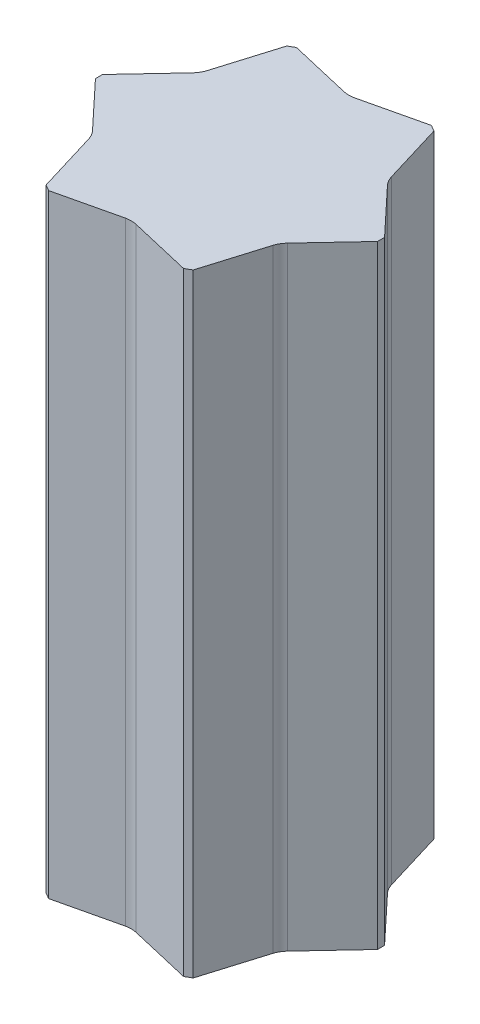
ISO-10303-21;
HEADER;
FILE_DESCRIPTION(('STEP AP214'),'2;1');
FILE_NAME('part.step','',(''),(''),'','','');
FILE_SCHEMA(('AUTOMOTIVE_DESIGN { 1 0 10303 214 1 1 1 1 }'));
ENDSEC;
DATA;
#1=APPLICATION_CONTEXT('core data for automotive mechanical design processes');
#2=APPLICATION_PROTOCOL_DEFINITION('international standard','automotive_design',2000,#1);
#3=PRODUCT_CONTEXT('',#1,'mechanical');
#4=PRODUCT('Part','Part','',(#3));
#5=PRODUCT_RELATED_PRODUCT_CATEGORY('part','',(#4));
#6=PRODUCT_DEFINITION_FORMATION('','',#4);
#7=PRODUCT_DEFINITION_CONTEXT('part definition',#1,'design');
#8=PRODUCT_DEFINITION('design','',#6,#7);
#9=PRODUCT_DEFINITION_SHAPE('','',#8);
#10=(LENGTH_UNIT() NAMED_UNIT(*) SI_UNIT(.MILLI.,.METRE.));
#11=(NAMED_UNIT(*) PLANE_ANGLE_UNIT() SI_UNIT($,.RADIAN.));
#12=(NAMED_UNIT(*) SI_UNIT($,.STERADIAN.) SOLID_ANGLE_UNIT());
#13=UNCERTAINTY_MEASURE_WITH_UNIT(LENGTH_MEASURE(1.E-05),#10,'distance_accuracy_value','');
#14=(GEOMETRIC_REPRESENTATION_CONTEXT(3) GLOBAL_UNCERTAINTY_ASSIGNED_CONTEXT((#13)) GLOBAL_UNIT_ASSIGNED_CONTEXT((#10,
#11,#12)) REPRESENTATION_CONTEXT('',''));
#15=CARTESIAN_POINT('',(0.,0.,0.));
#16=DIRECTION('',(0.,0.,1.));
#17=DIRECTION('',(1.,0.,0.));
#18=AXIS2_PLACEMENT_3D('',#15,#16,#17);
#19=CARTESIAN_POINT('',(0.,1500.,0.));
#20=DIRECTION('',(0.,1.,0.));
#21=DIRECTION('',(0.,0.,1.));
#22=AXIS2_PLACEMENT_3D('',#19,#20,#21);
#23=PLANE('',#22);
#24=CARTESIAN_POINT('',(-279.782642064794,1500.,161.53258371069));
#25=DIRECTION('',(0.,1.,0.));
#26=DIRECTION('',(0.,0.,1.));
#27=AXIS2_PLACEMENT_3D('',#24,#25,#26);
#28=CIRCLE('',#27,57.0000000000118);
#29=CARTESIAN_POINT('',(-225.221371389546,1500.,145.038107595835));
#30=VERTEX_POINT('',#29);
#31=CARTESIAN_POINT('',(-238.21737138956,1500.,122.528375300625));
#32=VERTEX_POINT('',#31);
#33=EDGE_CURVE('E335',#30,#32,#28,.T.);
#34=ORIENTED_EDGE('',*,*,#33,.F.);
#35=DIRECTION('',(-0.289687341997274,0.,-0.957121331852213));
#36=VECTOR('',#35,1.);
#37=CARTESIAN_POINT('',(-225.221371389546,1500.,145.038107595835));
#38=LINE('',#37,#36);
#39=CARTESIAN_POINT('',(-179.999999999989,1500.,294.448637286717));
#40=VERTEX_POINT('',#39);
#41=EDGE_CURVE('E330',#40,#30,#38,.T.);
#42=ORIENTED_EDGE('',*,*,#41,.F.);
#43=DIRECTION('',(0.866025403784445,0.,0.499999999999989));
#44=VECTOR('',#43,1.);
#45=CARTESIAN_POINT('',(-180.,1500.,294.448637286709));
#46=LINE('',#45,#44);
#47=CARTESIAN_POINT('',(-164.999999999985,1500.,303.108891324554));
#48=VERTEX_POINT('',#47);
#49=EDGE_CURVE('E233',#40,#48,#46,.T.);
#50=ORIENTED_EDGE('',*,*,#49,.T.);
#51=DIRECTION('',(-0.973735058886646,0.,0.227684068601694));
#52=VECTOR('',#51,1.);
#53=CARTESIAN_POINT('',(-12.996000000002,1500.,267.566482896435));
#54=LINE('',#53,#52);
#55=CARTESIAN_POINT('',(-12.9960000000026,1500.,267.566482896433));
#56=VERTEX_POINT('',#55);
#57=EDGE_CURVE('E478',#56,#48,#54,.T.);
#58=ORIENTED_EDGE('',*,*,#57,.F.);
#59=CARTESIAN_POINT('',(-2.25942145351596E-12,1500.,323.065167421386));
#60=DIRECTION('',(0.,1.,0.));
#61=DIRECTION('',(0.,0.,1.));
#62=AXIS2_PLACEMENT_3D('',#59,#60,#61);
#63=CIRCLE('',#62,57.0000000000025);
#64=CARTESIAN_POINT('',(12.9960000000444,1500.,267.566482896441));
#65=VERTEX_POINT('',#64);
#66=EDGE_CURVE('E471',#65,#56,#63,.T.);
#67=ORIENTED_EDGE('',*,*,#66,.F.);
#68=DIRECTION('',(-0.97373505888665,0.,-0.227684068601677));
#69=VECTOR('',#68,1.);
#70=CARTESIAN_POINT('',(12.9960000000444,1500.,267.566482896441));
#71=LINE('',#70,#69);
#72=CARTESIAN_POINT('',(165.000000000015,1500.,303.108891324554));
#73=VERTEX_POINT('',#72);
#74=EDGE_CURVE('E467',#73,#65,#71,.T.);
#75=ORIENTED_EDGE('',*,*,#74,.F.);
#76=DIRECTION('',(0.866025403784436,0.,-0.500000000000004));
#77=VECTOR('',#76,1.);
#78=CARTESIAN_POINT('',(165.,1500.,303.108891324553));
#79=LINE('',#78,#77);
#80=CARTESIAN_POINT('',(180.000000000012,1500.,294.448637286703));
#81=VERTEX_POINT('',#80);
#82=EDGE_CURVE('E241',#73,#81,#79,.T.);
#83=ORIENTED_EDGE('',*,*,#82,.T.);
#84=DIRECTION('',(-0.289687341997226,0.,0.957121331852228));
#85=VECTOR('',#84,1.);
#86=CARTESIAN_POINT('',(225.221371389567,1500.,145.038107595801));
#87=LINE('',#86,#85);
#88=CARTESIAN_POINT('',(225.221371389566,1500.,145.038107595801));
#89=VERTEX_POINT('',#88);
#90=EDGE_CURVE('E382',#89,#81,#87,.T.);
#91=ORIENTED_EDGE('',*,*,#90,.F.);
#92=CARTESIAN_POINT('',(279.782642064801,1500.,161.532583710706));
#93=DIRECTION('',(0.,1.,0.));
#94=DIRECTION('',(0.,0.,1.));
#95=AXIS2_PLACEMENT_3D('',#92,#93,#94);
#96=CIRCLE('',#95,57.000000000012);
#97=CARTESIAN_POINT('',(238.217371389598,1500.,122.528375300606));
#98=VERTEX_POINT('',#97);
#99=EDGE_CURVE('E379',#98,#89,#96,.T.);
#100=ORIENTED_EDGE('',*,*,#99,.F.);
#101=DIRECTION('',(-0.684047716889375,0.,0.729437263250537));
#102=VECTOR('',#101,1.);
#103=CARTESIAN_POINT('',(238.217371389598,1500.,122.528375300606));
#104=LINE('',#103,#102);
#105=CARTESIAN_POINT('',(345.000000000012,1500.,8.66025403783843));
#106=VERTEX_POINT('',#105);
#107=EDGE_CURVE('E376',#106,#98,#104,.T.);
#108=ORIENTED_EDGE('',*,*,#107,.F.);
#109=DIRECTION('',(0.,0.,-1.));
#110=VECTOR('',#109,1.);
#111=CARTESIAN_POINT('',(345.,1500.,-8.66025403784437));
#112=LINE('',#111,#110);
#113=CARTESIAN_POINT('',(345.,1500.,-8.6602540378436));
#114=VERTEX_POINT('',#113);
#115=EDGE_CURVE('E252',#106,#114,#112,.T.);
#116=ORIENTED_EDGE('',*,*,#115,.T.);
#117=DIRECTION('',(0.684047716889376,0.,0.729437263250536));
#118=VECTOR('',#117,1.);
#119=CARTESIAN_POINT('',(238.217371389575,1500.,-122.528375300623));
#120=LINE('',#119,#118);
#121=CARTESIAN_POINT('',(238.217371389575,1500.,-122.528375300623));
#122=VERTEX_POINT('',#121);
#123=EDGE_CURVE('E409',#122,#114,#120,.T.);
#124=ORIENTED_EDGE('',*,*,#123,.F.);
#125=CARTESIAN_POINT('',(279.782642064811,1500.,-161.532583710687));
#126=DIRECTION('',(0.,1.,0.));
#127=DIRECTION('',(0.,0.,1.));
#128=AXIS2_PLACEMENT_3D('',#125,#126,#127);
#129=CIRCLE('',#128,57.0000000000121);
#130=CARTESIAN_POINT('',(225.221371389561,1500.,-145.038107595834));
#131=VERTEX_POINT('',#130);
#132=EDGE_CURVE('E405',#131,#122,#129,.T.);
#133=ORIENTED_EDGE('',*,*,#132,.F.);
#134=DIRECTION('',(0.289687341997307,0.,0.957121331852203));
#135=VECTOR('',#134,1.);
#136=CARTESIAN_POINT('',(225.221371389561,1500.,-145.038107595834));
#137=LINE('',#136,#135);
#138=CARTESIAN_POINT('',(180.000000000001,1500.,-294.448637286709));
#139=VERTEX_POINT('',#138);
#140=EDGE_CURVE('E402',#139,#131,#137,.T.);
#141=ORIENTED_EDGE('',*,*,#140,.F.);
#142=DIRECTION('',(-0.866025403784442,0.,-0.499999999999995));
#143=VECTOR('',#142,1.);
#144=CARTESIAN_POINT('',(165.,1500.,-303.108891324553));
#145=LINE('',#144,#143);
#146=CARTESIAN_POINT('',(165.,1500.,-303.108891324553));
#147=VERTEX_POINT('',#146);
#148=EDGE_CURVE('E256',#139,#147,#145,.T.);
#149=ORIENTED_EDGE('',*,*,#148,.T.);
#150=DIRECTION('',(0.973735058886638,0.,-0.227684068601727));
#151=VECTOR('',#150,1.);
#152=CARTESIAN_POINT('',(12.9960000000175,1500.,-267.566482896429));
#153=LINE('',#152,#151);
#154=CARTESIAN_POINT('',(12.9960000000175,1500.,-267.566482896429));
#155=VERTEX_POINT('',#154);
#156=EDGE_CURVE('E355',#155,#147,#153,.T.);
#157=ORIENTED_EDGE('',*,*,#156,.F.);
#158=CARTESIAN_POINT('',(1.8266864299827E-11,1500.,-323.065167421392));
#159=DIRECTION('',(0.,1.,0.));
#160=DIRECTION('',(0.,0.,1.));
#161=AXIS2_PLACEMENT_3D('',#158,#159,#160);
#162=CIRCLE('',#161,57.0000000000121);
#163=CARTESIAN_POINT('',(-12.9960000000291,1500.,-267.56648289644));
#164=VERTEX_POINT('',#163);
#165=EDGE_CURVE('E351',#164,#155,#162,.T.);
#166=ORIENTED_EDGE('',*,*,#165,.F.);
#167=DIRECTION('',(0.97373505888665,0.,0.227684068601677));
#168=VECTOR('',#167,1.);
#169=CARTESIAN_POINT('',(-12.9960000000291,1500.,-267.56648289644));
#170=LINE('',#169,#168);
#171=CARTESIAN_POINT('',(-165.,1500.,-303.108891324554));
#172=VERTEX_POINT('',#171);
#173=EDGE_CURVE('E348',#172,#164,#170,.T.);
#174=ORIENTED_EDGE('',*,*,#173,.F.);
#175=DIRECTION('',(-0.866025403784439,0.,0.499999999999999));
#176=VECTOR('',#175,1.);
#177=CARTESIAN_POINT('',(-180.,1500.,-294.448637286709));
#178=LINE('',#177,#176);
#179=CARTESIAN_POINT('',(-179.999999999997,1500.,-294.448637286702));
#180=VERTEX_POINT('',#179);
#181=EDGE_CURVE('E234',#172,#180,#178,.T.);
#182=ORIENTED_EDGE('',*,*,#181,.T.);
#183=DIRECTION('',(0.289687341997224,0.,-0.957121331852228));
#184=VECTOR('',#183,1.);
#185=CARTESIAN_POINT('',(-225.22137138955,1500.,-145.038107595805));
#186=LINE('',#185,#184);
#187=CARTESIAN_POINT('',(-225.22137138955,1500.,-145.038107595805));
#188=VERTEX_POINT('',#187);
#189=EDGE_CURVE('E509',#188,#180,#186,.T.);
#190=ORIENTED_EDGE('',*,*,#189,.F.);
#191=CARTESIAN_POINT('',(-279.782642064786,1500.,-161.532583710705));
#192=DIRECTION('',(0.,1.,0.));
#193=DIRECTION('',(0.,0.,1.));
#194=AXIS2_PLACEMENT_3D('',#191,#192,#193);
#195=CIRCLE('',#194,57.0000000000121);
#196=CARTESIAN_POINT('',(-238.217371389583,1500.,-122.528375300605));
#197=VERTEX_POINT('',#196);
#198=EDGE_CURVE('E227',#197,#188,#195,.T.);
#199=ORIENTED_EDGE('',*,*,#198,.F.);
#200=DIRECTION('',(0.684047716889375,0.,-0.729437263250537));
#201=VECTOR('',#200,1.);
#202=CARTESIAN_POINT('',(-238.217371389583,1500.,-122.528375300605));
#203=LINE('',#202,#201);
#204=CARTESIAN_POINT('',(-344.999999999997,1500.,-8.66025403783737));
#205=VERTEX_POINT('',#204);
#206=EDGE_CURVE('E209',#205,#197,#203,.T.);
#207=ORIENTED_EDGE('',*,*,#206,.F.);
#208=DIRECTION('',(0.,0.,1.));
#209=VECTOR('',#208,1.);
#210=CARTESIAN_POINT('',(-345.,1500.,-8.66025403784437));
#211=LINE('',#210,#209);
#212=CARTESIAN_POINT('',(-344.999999999989,1500.,8.66025403785184));
#213=VERTEX_POINT('',#212);
#214=EDGE_CURVE('E224',#205,#213,#211,.T.);
#215=ORIENTED_EDGE('',*,*,#214,.T.);
#216=DIRECTION('',(-0.684047716889414,0.,-0.7294372632505));
#217=VECTOR('',#216,1.);
#218=CARTESIAN_POINT('',(-238.217371389559,1500.,122.528375300624));
#219=LINE('',#218,#217);
#220=EDGE_CURVE('E323',#32,#213,#219,.T.);
#221=ORIENTED_EDGE('',*,*,#220,.F.);
#222=EDGE_LOOP('',(#34,#42,#50,#58,#67,#75,#83,#91,#100,#108,#116,#124,#133,#141,#149,#157,#166,
#174,#182,#190,#199,#207,#215,#221));
#223=FACE_BOUND('',#222,.T.);
#224=ADVANCED_FACE('F45',(#223),#23,.T.);
#225=CARTESIAN_POINT('',(0.,0.,0.));
#226=DIRECTION('',(0.,1.,0.));
#227=DIRECTION('',(0.,0.,1.));
#228=AXIS2_PLACEMENT_3D('',#225,#226,#227);
#229=PLANE('',#228);
#230=DIRECTION('',(-0.289687341997274,0.,-0.957121331852213));
#231=VECTOR('',#230,1.);
#232=CARTESIAN_POINT('',(-225.221371389546,0.,145.038107595835));
#233=LINE('',#232,#231);
#234=CARTESIAN_POINT('',(-179.999999999989,0.,294.448637286717));
#235=VERTEX_POINT('',#234);
#236=CARTESIAN_POINT('',(-225.221371389546,0.,145.038107595835));
#237=VERTEX_POINT('',#236);
#238=EDGE_CURVE('E338',#235,#237,#233,.T.);
#239=ORIENTED_EDGE('',*,*,#238,.T.);
#240=CARTESIAN_POINT('',(-279.782642064794,0.,161.53258371069));
#241=DIRECTION('',(0.,1.,0.));
#242=DIRECTION('',(0.,0.,1.));
#243=AXIS2_PLACEMENT_3D('',#240,#241,#242);
#244=CIRCLE('',#243,57.0000000000118);
#245=CARTESIAN_POINT('',(-238.21737138956,0.,122.528375300625));
#246=VERTEX_POINT('',#245);
#247=EDGE_CURVE('E328',#237,#246,#244,.T.);
#248=ORIENTED_EDGE('',*,*,#247,.T.);
#249=DIRECTION('',(-0.684047716889414,0.,-0.7294372632505));
#250=VECTOR('',#249,1.);
#251=CARTESIAN_POINT('',(-238.217371389559,0.,122.528375300624));
#252=LINE('',#251,#250);
#253=CARTESIAN_POINT('',(-345.,0.,8.66025403784437));
#254=VERTEX_POINT('',#253);
#255=EDGE_CURVE('E321',#246,#254,#252,.T.);
#256=ORIENTED_EDGE('',*,*,#255,.T.);
#257=DIRECTION('',(0.,0.,1.));
#258=VECTOR('',#257,1.);
#259=CARTESIAN_POINT('',(-345.,0.,-8.66025403784437));
#260=LINE('',#259,#258);
#261=CARTESIAN_POINT('',(-344.999999999997,0.,-8.66025403783737));
#262=VERTEX_POINT('',#261);
#263=EDGE_CURVE('E265',#262,#254,#260,.T.);
#264=ORIENTED_EDGE('',*,*,#263,.F.);
#265=DIRECTION('',(0.684047716889375,0.,-0.729437263250537));
#266=VECTOR('',#265,1.);
#267=CARTESIAN_POINT('',(-238.217371389583,0.,-122.528375300605));
#268=LINE('',#267,#266);
#269=CARTESIAN_POINT('',(-238.217371389583,0.,-122.528375300605));
#270=VERTEX_POINT('',#269);
#271=EDGE_CURVE('E212',#262,#270,#268,.T.);
#272=ORIENTED_EDGE('',*,*,#271,.T.);
#273=CARTESIAN_POINT('',(-279.782642064786,0.,-161.532583710705));
#274=DIRECTION('',(0.,1.,0.));
#275=DIRECTION('',(0.,0.,1.));
#276=AXIS2_PLACEMENT_3D('',#273,#274,#275);
#277=CIRCLE('',#276,57.0000000000121);
#278=CARTESIAN_POINT('',(-225.22137138955,0.,-145.038107595805));
#279=VERTEX_POINT('',#278);
#280=EDGE_CURVE('E519',#270,#279,#277,.T.);
#281=ORIENTED_EDGE('',*,*,#280,.T.);
#282=DIRECTION('',(0.289687341997224,0.,-0.957121331852228));
#283=VECTOR('',#282,1.);
#284=CARTESIAN_POINT('',(-225.22137138955,0.,-145.038107595805));
#285=LINE('',#284,#283);
#286=CARTESIAN_POINT('',(-180.,0.,-294.448637286709));
#287=VERTEX_POINT('',#286);
#288=EDGE_CURVE('E229',#279,#287,#285,.T.);
#289=ORIENTED_EDGE('',*,*,#288,.T.);
#290=DIRECTION('',(-0.866025403784439,0.,0.499999999999999));
#291=VECTOR('',#290,1.);
#292=CARTESIAN_POINT('',(-180.,0.,-294.448637286709));
#293=LINE('',#292,#291);
#294=CARTESIAN_POINT('',(-165.,0.,-303.108891324554));
#295=VERTEX_POINT('',#294);
#296=EDGE_CURVE('E261',#295,#287,#293,.T.);
#297=ORIENTED_EDGE('',*,*,#296,.F.);
#298=DIRECTION('',(0.97373505888665,0.,0.227684068601677));
#299=VECTOR('',#298,1.);
#300=CARTESIAN_POINT('',(-12.9960000000291,0.,-267.56648289644));
#301=LINE('',#300,#299);
#302=CARTESIAN_POINT('',(-12.9960000000291,0.,-267.56648289644));
#303=VERTEX_POINT('',#302);
#304=EDGE_CURVE('E359',#295,#303,#301,.T.);
#305=ORIENTED_EDGE('',*,*,#304,.T.);
#306=CARTESIAN_POINT('',(1.8266864299827E-11,0.,-323.065167421392));
#307=DIRECTION('',(0.,1.,0.));
#308=DIRECTION('',(0.,0.,1.));
#309=AXIS2_PLACEMENT_3D('',#306,#307,#308);
#310=CIRCLE('',#309,57.0000000000121);
#311=CARTESIAN_POINT('',(12.9960000000175,0.,-267.566482896429));
#312=VERTEX_POINT('',#311);
#313=EDGE_CURVE('E363',#303,#312,#310,.T.);
#314=ORIENTED_EDGE('',*,*,#313,.T.);
#315=DIRECTION('',(0.973735058886638,0.,-0.227684068601727));
#316=VECTOR('',#315,1.);
#317=CARTESIAN_POINT('',(12.9960000000175,0.,-267.566482896429));
#318=LINE('',#317,#316);
#319=CARTESIAN_POINT('',(165.,0.,-303.108891324553));
#320=VERTEX_POINT('',#319);
#321=EDGE_CURVE('E352',#312,#320,#318,.T.);
#322=ORIENTED_EDGE('',*,*,#321,.T.);
#323=DIRECTION('',(-0.866025403784442,0.,-0.499999999999995));
#324=VECTOR('',#323,1.);
#325=CARTESIAN_POINT('',(165.,0.,-303.108891324553));
#326=LINE('',#325,#324);
#327=CARTESIAN_POINT('',(180.000000000001,0.,-294.448637286709));
#328=VERTEX_POINT('',#327);
#329=EDGE_CURVE('E245',#328,#320,#326,.T.);
#330=ORIENTED_EDGE('',*,*,#329,.F.);
#331=DIRECTION('',(0.289687341997307,0.,0.957121331852203));
#332=VECTOR('',#331,1.);
#333=CARTESIAN_POINT('',(225.221371389561,0.,-145.038107595834));
#334=LINE('',#333,#332);
#335=CARTESIAN_POINT('',(225.221371389561,0.,-145.038107595834));
#336=VERTEX_POINT('',#335);
#337=EDGE_CURVE('E375',#328,#336,#334,.T.);
#338=ORIENTED_EDGE('',*,*,#337,.T.);
#339=CARTESIAN_POINT('',(279.782642064811,0.,-161.532583710687));
#340=DIRECTION('',(0.,1.,0.));
#341=DIRECTION('',(0.,0.,1.));
#342=AXIS2_PLACEMENT_3D('',#339,#340,#341);
#343=CIRCLE('',#342,57.0000000000121);
#344=CARTESIAN_POINT('',(238.217371389575,0.,-122.528375300623));
#345=VERTEX_POINT('',#344);
#346=EDGE_CURVE('E416',#336,#345,#343,.T.);
#347=ORIENTED_EDGE('',*,*,#346,.T.);
#348=DIRECTION('',(0.684047716889376,0.,0.729437263250536));
#349=VECTOR('',#348,1.);
#350=CARTESIAN_POINT('',(238.217371389575,0.,-122.528375300623));
#351=LINE('',#350,#349);
#352=CARTESIAN_POINT('',(345.,0.,-8.66025403784437));
#353=VERTEX_POINT('',#352);
#354=EDGE_CURVE('E406',#345,#353,#351,.T.);
#355=ORIENTED_EDGE('',*,*,#354,.T.);
#356=DIRECTION('',(0.,0.,-1.));
#357=VECTOR('',#356,1.);
#358=CARTESIAN_POINT('',(345.,0.,-8.66025403784437));
#359=LINE('',#358,#357);
#360=CARTESIAN_POINT('',(345.000000000012,0.,8.66025403783843));
#361=VERTEX_POINT('',#360);
#362=EDGE_CURVE('E277',#361,#353,#359,.T.);
#363=ORIENTED_EDGE('',*,*,#362,.F.);
#364=DIRECTION('',(-0.684047716889375,0.,0.729437263250537));
#365=VECTOR('',#364,1.);
#366=CARTESIAN_POINT('',(238.217371389598,0.,122.528375300606));
#367=LINE('',#366,#365);
#368=CARTESIAN_POINT('',(238.217371389598,0.,122.528375300606));
#369=VERTEX_POINT('',#368);
#370=EDGE_CURVE('E386',#361,#369,#367,.T.);
#371=ORIENTED_EDGE('',*,*,#370,.T.);
#372=CARTESIAN_POINT('',(279.782642064801,0.,161.532583710706));
#373=DIRECTION('',(0.,1.,0.));
#374=DIRECTION('',(0.,0.,1.));
#375=AXIS2_PLACEMENT_3D('',#372,#373,#374);
#376=CIRCLE('',#375,57.000000000012);
#377=CARTESIAN_POINT('',(225.221371389566,0.,145.038107595801));
#378=VERTEX_POINT('',#377);
#379=EDGE_CURVE('E390',#369,#378,#376,.T.);
#380=ORIENTED_EDGE('',*,*,#379,.T.);
#381=DIRECTION('',(-0.289687341997226,0.,0.957121331852228));
#382=VECTOR('',#381,1.);
#383=CARTESIAN_POINT('',(225.221371389567,0.,145.038107595801));
#384=LINE('',#383,#382);
#385=CARTESIAN_POINT('',(180.,0.,294.448637286709));
#386=VERTEX_POINT('',#385);
#387=EDGE_CURVE('E380',#378,#386,#384,.T.);
#388=ORIENTED_EDGE('',*,*,#387,.T.);
#389=DIRECTION('',(0.866025403784436,0.,-0.500000000000004));
#390=VECTOR('',#389,1.);
#391=CARTESIAN_POINT('',(165.,0.,303.108891324553));
#392=LINE('',#391,#390);
#393=CARTESIAN_POINT('',(165.000000000015,0.,303.108891324554));
#394=VERTEX_POINT('',#393);
#395=EDGE_CURVE('E273',#394,#386,#392,.T.);
#396=ORIENTED_EDGE('',*,*,#395,.F.);
#397=DIRECTION('',(-0.97373505888665,0.,-0.227684068601677));
#398=VECTOR('',#397,1.);
#399=CARTESIAN_POINT('',(12.9960000000444,0.,267.566482896441));
#400=LINE('',#399,#398);
#401=CARTESIAN_POINT('',(12.9960000000444,0.,267.566482896441));
#402=VERTEX_POINT('',#401);
#403=EDGE_CURVE('E347',#394,#402,#400,.T.);
#404=ORIENTED_EDGE('',*,*,#403,.T.);
#405=CARTESIAN_POINT('',(-2.25942145351596E-12,0.,323.065167421386));
#406=DIRECTION('',(0.,1.,0.));
#407=DIRECTION('',(0.,0.,1.));
#408=AXIS2_PLACEMENT_3D('',#405,#406,#407);
#409=CIRCLE('',#408,57.0000000000025);
#410=CARTESIAN_POINT('',(-12.9960000000026,0.,267.566482896433));
#411=VERTEX_POINT('',#410);
#412=EDGE_CURVE('E481',#402,#411,#409,.T.);
#413=ORIENTED_EDGE('',*,*,#412,.T.);
#414=DIRECTION('',(-0.973735058886646,0.,0.227684068601694));
#415=VECTOR('',#414,1.);
#416=CARTESIAN_POINT('',(-12.996000000002,0.,267.566482896435));
#417=LINE('',#416,#415);
#418=CARTESIAN_POINT('',(-165.,0.,303.108891324553));
#419=VERTEX_POINT('',#418);
#420=EDGE_CURVE('E473',#411,#419,#417,.T.);
#421=ORIENTED_EDGE('',*,*,#420,.T.);
#422=DIRECTION('',(0.866025403784445,0.,0.499999999999989));
#423=VECTOR('',#422,1.);
#424=CARTESIAN_POINT('',(-180.,0.,294.448637286709));
#425=LINE('',#424,#423);
#426=EDGE_CURVE('E269',#235,#419,#425,.T.);
#427=ORIENTED_EDGE('',*,*,#426,.F.);
#428=EDGE_LOOP('',(#239,#248,#256,#264,#272,#281,#289,#297,#305,#314,#322,#330,#338,#347,#355,
#363,#371,#380,#388,#396,#404,#413,#421,#427));
#429=FACE_BOUND('',#428,.T.);
#430=ADVANCED_FACE('F326',(#429),#229,.F.);
#431=CARTESIAN_POINT('',(-180.,1500.,-294.448637286709));
#432=DIRECTION('',(0.499999999999999,0.,0.866025403784439));
#433=DIRECTION('',(0.866025403784439,0.,-0.499999999999999));
#434=AXIS2_PLACEMENT_3D('',#431,#432,#433);
#435=PLANE('',#434);
#436=ORIENTED_EDGE('',*,*,#296,.T.);
#437=DIRECTION('',(0.,-1.,0.));
#438=VECTOR('',#437,1.);
#439=CARTESIAN_POINT('',(-180.,1500.,-294.448637286709));
#440=LINE('',#439,#438);
#441=EDGE_CURVE('E11',#180,#287,#440,.T.);
#442=ORIENTED_EDGE('',*,*,#441,.F.);
#443=ORIENTED_EDGE('',*,*,#181,.F.);
#444=DIRECTION('',(0.,-1.,0.));
#445=VECTOR('',#444,1.);
#446=CARTESIAN_POINT('',(-165.,1500.,-303.108891324554));
#447=LINE('',#446,#445);
#448=EDGE_CURVE('E260',#172,#295,#447,.T.);
#449=ORIENTED_EDGE('',*,*,#448,.T.);
#450=EDGE_LOOP('',(#436,#442,#443,#449));
#451=FACE_BOUND('',#450,.T.);
#452=ADVANCED_FACE('F47',(#451),#435,.F.);
#453=CARTESIAN_POINT('',(-345.,1500.,-8.66025403784437));
#454=DIRECTION('',(1.,0.,0.));
#455=DIRECTION('',(0.,0.,-1.));
#456=AXIS2_PLACEMENT_3D('',#453,#454,#455);
#457=PLANE('',#456);
#458=ORIENTED_EDGE('',*,*,#263,.T.);
#459=DIRECTION('',(0.,-1.,0.));
#460=VECTOR('',#459,1.);
#461=CARTESIAN_POINT('',(-345.,1500.,8.66025403784437));
#462=LINE('',#461,#460);
#463=EDGE_CURVE('E218',#213,#254,#462,.T.);
#464=ORIENTED_EDGE('',*,*,#463,.F.);
#465=ORIENTED_EDGE('',*,*,#214,.F.);
#466=DIRECTION('',(0.,-1.,0.));
#467=VECTOR('',#466,1.);
#468=CARTESIAN_POINT('',(-345.,1500.,-8.66025403784437));
#469=LINE('',#468,#467);
#470=EDGE_CURVE('E54',#205,#262,#469,.T.);
#471=ORIENTED_EDGE('',*,*,#470,.T.);
#472=EDGE_LOOP('',(#458,#464,#465,#471));
#473=FACE_BOUND('',#472,.T.);
#474=ADVANCED_FACE('F231',(#473),#457,.F.);
#475=CARTESIAN_POINT('',(-180.,1500.,294.448637286709));
#476=DIRECTION('',(0.499999999999989,0.,-0.866025403784445));
#477=DIRECTION('',(-0.866025403784445,0.,-0.49999999999999));
#478=AXIS2_PLACEMENT_3D('',#475,#476,#477);
#479=PLANE('',#478);
#480=ORIENTED_EDGE('',*,*,#426,.T.);
#481=DIRECTION('',(0.,-1.,0.));
#482=VECTOR('',#481,1.);
#483=CARTESIAN_POINT('',(-165.,1500.,303.108891324553));
#484=LINE('',#483,#482);
#485=EDGE_CURVE('E306',#48,#419,#484,.T.);
#486=ORIENTED_EDGE('',*,*,#485,.F.);
#487=ORIENTED_EDGE('',*,*,#49,.F.);
#488=DIRECTION('',(0.,-1.,0.));
#489=VECTOR('',#488,1.);
#490=CARTESIAN_POINT('',(-180.,1500.,294.448637286709));
#491=LINE('',#490,#489);
#492=EDGE_CURVE('E309',#40,#235,#491,.T.);
#493=ORIENTED_EDGE('',*,*,#492,.T.);
#494=EDGE_LOOP('',(#480,#486,#487,#493));
#495=FACE_BOUND('',#494,.T.);
#496=ADVANCED_FACE('F568',(#495),#479,.F.);
#497=CARTESIAN_POINT('',(165.,1500.,303.108891324553));
#498=DIRECTION('',(-0.500000000000004,0.,-0.866025403784436));
#499=DIRECTION('',(-0.866025403784436,0.,0.500000000000004));
#500=AXIS2_PLACEMENT_3D('',#497,#498,#499);
#501=PLANE('',#500);
#502=ORIENTED_EDGE('',*,*,#395,.T.);
#503=DIRECTION('',(0.,-1.,0.));
#504=VECTOR('',#503,1.);
#505=CARTESIAN_POINT('',(180.,1500.,294.448637286709));
#506=LINE('',#505,#504);
#507=EDGE_CURVE('E299',#81,#386,#506,.T.);
#508=ORIENTED_EDGE('',*,*,#507,.F.);
#509=ORIENTED_EDGE('',*,*,#82,.F.);
#510=DIRECTION('',(0.,-1.,0.));
#511=VECTOR('',#510,1.);
#512=CARTESIAN_POINT('',(165.,1500.,303.108891324553));
#513=LINE('',#512,#511);
#514=EDGE_CURVE('E302',#73,#394,#513,.T.);
#515=ORIENTED_EDGE('',*,*,#514,.T.);
#516=EDGE_LOOP('',(#502,#508,#509,#515));
#517=FACE_BOUND('',#516,.T.);
#518=ADVANCED_FACE('F462',(#517),#501,.F.);
#519=CARTESIAN_POINT('',(345.,1500.,-8.66025403784437));
#520=DIRECTION('',(-1.,0.,0.));
#521=DIRECTION('',(0.,0.,1.));
#522=AXIS2_PLACEMENT_3D('',#519,#520,#521);
#523=PLANE('',#522);
#524=ORIENTED_EDGE('',*,*,#362,.T.);
#525=DIRECTION('',(0.,-1.,0.));
#526=VECTOR('',#525,1.);
#527=CARTESIAN_POINT('',(345.,1500.,-8.66025403784437));
#528=LINE('',#527,#526);
#529=EDGE_CURVE('E69',#114,#353,#528,.T.);
#530=ORIENTED_EDGE('',*,*,#529,.F.);
#531=ORIENTED_EDGE('',*,*,#115,.F.);
#532=DIRECTION('',(0.,-1.,0.));
#533=VECTOR('',#532,1.);
#534=CARTESIAN_POINT('',(345.,1500.,8.66025403784437));
#535=LINE('',#534,#533);
#536=EDGE_CURVE('E295',#106,#361,#535,.T.);
#537=ORIENTED_EDGE('',*,*,#536,.T.);
#538=EDGE_LOOP('',(#524,#530,#531,#537));
#539=FACE_BOUND('',#538,.T.);
#540=ADVANCED_FACE('F443',(#539),#523,.F.);
#541=CARTESIAN_POINT('',(165.,1500.,-303.108891324553));
#542=DIRECTION('',(-0.499999999999995,0.,0.866025403784442));
#543=DIRECTION('',(0.866025403784442,0.,0.499999999999995));
#544=AXIS2_PLACEMENT_3D('',#541,#542,#543);
#545=PLANE('',#544);
#546=ORIENTED_EDGE('',*,*,#329,.T.);
#547=DIRECTION('',(0.,-1.,0.));
#548=VECTOR('',#547,1.);
#549=CARTESIAN_POINT('',(165.,1500.,-303.108891324553));
#550=LINE('',#549,#548);
#551=EDGE_CURVE('E61',#147,#320,#550,.T.);
#552=ORIENTED_EDGE('',*,*,#551,.F.);
#553=ORIENTED_EDGE('',*,*,#148,.F.);
#554=DIRECTION('',(0.,-1.,0.));
#555=VECTOR('',#554,1.);
#556=CARTESIAN_POINT('',(180.,1500.,-294.448637286709));
#557=LINE('',#556,#555);
#558=EDGE_CURVE('E289',#139,#328,#557,.T.);
#559=ORIENTED_EDGE('',*,*,#558,.T.);
#560=EDGE_LOOP('',(#546,#552,#553,#559));
#561=FACE_BOUND('',#560,.T.);
#562=ADVANCED_FACE('F436',(#561),#545,.F.);
#563=CARTESIAN_POINT('',(225.221371389561,1500.,-145.038107595834));
#564=DIRECTION('',(0.957121331852203,0.,-0.289687341997307));
#565=DIRECTION('',(-0.289687341997307,0.,-0.957121331852203));
#566=AXIS2_PLACEMENT_3D('',#563,#564,#565);
#567=PLANE('',#566);
#568=ORIENTED_EDGE('',*,*,#337,.F.);
#569=ORIENTED_EDGE('',*,*,#558,.F.);
#570=ORIENTED_EDGE('',*,*,#140,.T.);
#571=DIRECTION('',(0.,-1.,0.));
#572=VECTOR('',#571,1.);
#573=CARTESIAN_POINT('',(225.221371389561,1500.,-145.038107595834));
#574=LINE('',#573,#572);
#575=EDGE_CURVE('E266',#131,#336,#574,.T.);
#576=ORIENTED_EDGE('',*,*,#575,.T.);
#577=EDGE_LOOP('',(#568,#569,#570,#576));
#578=FACE_BOUND('',#577,.T.);
#579=ADVANCED_FACE('F428',(#578),#567,.T.);
#580=CARTESIAN_POINT('',(279.782642064811,1500.,-161.532583710687));
#581=DIRECTION('',(0.,-1.,0.));
#582=DIRECTION('',(0.,0.,-1.));
#583=AXIS2_PLACEMENT_3D('',#580,#581,#582);
#584=CYLINDRICAL_SURFACE('',#583,57.0000000000121);
#585=ORIENTED_EDGE('',*,*,#346,.F.);
#586=ORIENTED_EDGE('',*,*,#575,.F.);
#587=ORIENTED_EDGE('',*,*,#132,.T.);
#588=DIRECTION('',(0.,-1.,0.));
#589=VECTOR('',#588,1.);
#590=CARTESIAN_POINT('',(238.217371389575,1500.,-122.528375300623));
#591=LINE('',#590,#589);
#592=EDGE_CURVE('E412',#122,#345,#591,.T.);
#593=ORIENTED_EDGE('',*,*,#592,.T.);
#594=EDGE_LOOP('',(#585,#586,#587,#593));
#595=FACE_BOUND('',#594,.T.);
#596=ADVANCED_FACE('F432',(#595),#584,.F.);
#597=CARTESIAN_POINT('',(238.217371389575,1500.,-122.528375300623));
#598=DIRECTION('',(0.729437263250536,0.,-0.684047716889376));
#599=DIRECTION('',(-0.684047716889376,0.,-0.729437263250536));
#600=AXIS2_PLACEMENT_3D('',#597,#598,#599);
#601=PLANE('',#600);
#602=ORIENTED_EDGE('',*,*,#354,.F.);
#603=ORIENTED_EDGE('',*,*,#592,.F.);
#604=ORIENTED_EDGE('',*,*,#123,.T.);
#605=ORIENTED_EDGE('',*,*,#529,.T.);
#606=EDGE_LOOP('',(#602,#603,#604,#605));
#607=FACE_BOUND('',#606,.T.);
#608=ADVANCED_FACE('F440',(#607),#601,.T.);
#609=CARTESIAN_POINT('',(-238.217371389583,1500.,-122.528375300605));
#610=DIRECTION('',(-0.729437263250537,0.,-0.684047716889375));
#611=DIRECTION('',(-0.684047716889375,0.,0.729437263250537));
#612=AXIS2_PLACEMENT_3D('',#609,#610,#611);
#613=PLANE('',#612);
#614=ORIENTED_EDGE('',*,*,#271,.F.);
#615=ORIENTED_EDGE('',*,*,#470,.F.);
#616=ORIENTED_EDGE('',*,*,#206,.T.);
#617=DIRECTION('',(0.,-1.,0.));
#618=VECTOR('',#617,1.);
#619=CARTESIAN_POINT('',(-238.217371389583,1500.,-122.528375300605));
#620=LINE('',#619,#618);
#621=EDGE_CURVE('E484',#197,#270,#620,.T.);
#622=ORIENTED_EDGE('',*,*,#621,.T.);
#623=EDGE_LOOP('',(#614,#615,#616,#622));
#624=FACE_BOUND('',#623,.T.);
#625=ADVANCED_FACE('F208',(#624),#613,.T.);
#626=CARTESIAN_POINT('',(-279.782642064786,1500.,-161.532583710705));
#627=DIRECTION('',(0.,-1.,0.));
#628=DIRECTION('',(0.,0.,-1.));
#629=AXIS2_PLACEMENT_3D('',#626,#627,#628);
#630=CYLINDRICAL_SURFACE('',#629,57.0000000000121);
#631=ORIENTED_EDGE('',*,*,#280,.F.);
#632=ORIENTED_EDGE('',*,*,#621,.F.);
#633=ORIENTED_EDGE('',*,*,#198,.T.);
#634=DIRECTION('',(0.,-1.,0.));
#635=VECTOR('',#634,1.);
#636=CARTESIAN_POINT('',(-225.22137138955,1500.,-145.038107595805));
#637=LINE('',#636,#635);
#638=EDGE_CURVE('E505',#188,#279,#637,.T.);
#639=ORIENTED_EDGE('',*,*,#638,.T.);
#640=EDGE_LOOP('',(#631,#632,#633,#639));
#641=FACE_BOUND('',#640,.T.);
#642=ADVANCED_FACE('F527',(#641),#630,.F.);
#643=CARTESIAN_POINT('',(-225.22137138955,1500.,-145.038107595805));
#644=DIRECTION('',(-0.957121331852228,0.,-0.289687341997224));
#645=DIRECTION('',(-0.289687341997224,0.,0.957121331852229));
#646=AXIS2_PLACEMENT_3D('',#643,#644,#645);
#647=PLANE('',#646);
#648=ORIENTED_EDGE('',*,*,#288,.F.);
#649=ORIENTED_EDGE('',*,*,#638,.F.);
#650=ORIENTED_EDGE('',*,*,#189,.T.);
#651=ORIENTED_EDGE('',*,*,#441,.T.);
#652=EDGE_LOOP('',(#648,#649,#650,#651));
#653=FACE_BOUND('',#652,.T.);
#654=ADVANCED_FACE('F529',(#653),#647,.T.);
#655=CARTESIAN_POINT('',(-12.9960000000291,1500.,-267.56648289644));
#656=DIRECTION('',(0.227684068601677,0.,-0.973735058886649));
#657=DIRECTION('',(-0.97373505888665,0.,-0.227684068601677));
#658=AXIS2_PLACEMENT_3D('',#655,#656,#657);
#659=PLANE('',#658);
#660=ORIENTED_EDGE('',*,*,#304,.F.);
#661=ORIENTED_EDGE('',*,*,#448,.F.);
#662=ORIENTED_EDGE('',*,*,#173,.T.);
#663=DIRECTION('',(0.,-1.,0.));
#664=VECTOR('',#663,1.);
#665=CARTESIAN_POINT('',(-12.9960000000291,1500.,-267.56648289644));
#666=LINE('',#665,#664);
#667=EDGE_CURVE('E372',#164,#303,#666,.T.);
#668=ORIENTED_EDGE('',*,*,#667,.T.);
#669=EDGE_LOOP('',(#660,#661,#662,#668));
#670=FACE_BOUND('',#669,.T.);
#671=ADVANCED_FACE('F538',(#670),#659,.T.);
#672=CARTESIAN_POINT('',(1.8266864299827E-11,1500.,-323.065167421392));
#673=DIRECTION('',(0.,-1.,0.));
#674=DIRECTION('',(0.,0.,-1.));
#675=AXIS2_PLACEMENT_3D('',#672,#673,#674);
#676=CYLINDRICAL_SURFACE('',#675,57.0000000000121);
#677=ORIENTED_EDGE('',*,*,#313,.F.);
#678=ORIENTED_EDGE('',*,*,#667,.F.);
#679=ORIENTED_EDGE('',*,*,#165,.T.);
#680=DIRECTION('',(0.,-1.,0.));
#681=VECTOR('',#680,1.);
#682=CARTESIAN_POINT('',(12.9960000000175,1500.,-267.566482896429));
#683=LINE('',#682,#681);
#684=EDGE_CURVE('E358',#155,#312,#683,.T.);
#685=ORIENTED_EDGE('',*,*,#684,.T.);
#686=EDGE_LOOP('',(#677,#678,#679,#685));
#687=FACE_BOUND('',#686,.T.);
#688=ADVANCED_FACE('F541',(#687),#676,.F.);
#689=CARTESIAN_POINT('',(12.9960000000175,1500.,-267.566482896429));
#690=DIRECTION('',(-0.227684068601727,0.,-0.973735058886638));
#691=DIRECTION('',(-0.973735058886638,0.,0.227684068601727));
#692=AXIS2_PLACEMENT_3D('',#689,#690,#691);
#693=PLANE('',#692);
#694=ORIENTED_EDGE('',*,*,#321,.F.);
#695=ORIENTED_EDGE('',*,*,#684,.F.);
#696=ORIENTED_EDGE('',*,*,#156,.T.);
#697=ORIENTED_EDGE('',*,*,#551,.T.);
#698=EDGE_LOOP('',(#694,#695,#696,#697));
#699=FACE_BOUND('',#698,.T.);
#700=ADVANCED_FACE('F543',(#699),#693,.T.);
#701=CARTESIAN_POINT('',(238.217371389598,1500.,122.528375300606));
#702=DIRECTION('',(0.729437263250537,0.,0.684047716889375));
#703=DIRECTION('',(0.684047716889375,0.,-0.729437263250537));
#704=AXIS2_PLACEMENT_3D('',#701,#702,#703);
#705=PLANE('',#704);
#706=ORIENTED_EDGE('',*,*,#370,.F.);
#707=ORIENTED_EDGE('',*,*,#536,.F.);
#708=ORIENTED_EDGE('',*,*,#107,.T.);
#709=DIRECTION('',(0.,-1.,0.));
#710=VECTOR('',#709,1.);
#711=CARTESIAN_POINT('',(238.217371389598,1500.,122.528375300606));
#712=LINE('',#711,#710);
#713=EDGE_CURVE('E364',#98,#369,#712,.T.);
#714=ORIENTED_EDGE('',*,*,#713,.T.);
#715=EDGE_LOOP('',(#706,#707,#708,#714));
#716=FACE_BOUND('',#715,.T.);
#717=ADVANCED_FACE('F447',(#716),#705,.T.);
#718=CARTESIAN_POINT('',(279.782642064801,1500.,161.532583710706));
#719=DIRECTION('',(0.,-1.,0.));
#720=DIRECTION('',(0.,0.,-1.));
#721=AXIS2_PLACEMENT_3D('',#718,#719,#720);
#722=CYLINDRICAL_SURFACE('',#721,57.000000000012);
#723=ORIENTED_EDGE('',*,*,#379,.F.);
#724=ORIENTED_EDGE('',*,*,#713,.F.);
#725=ORIENTED_EDGE('',*,*,#99,.T.);
#726=DIRECTION('',(0.,-1.,0.));
#727=VECTOR('',#726,1.);
#728=CARTESIAN_POINT('',(225.221371389566,1500.,145.038107595801));
#729=LINE('',#728,#727);
#730=EDGE_CURVE('E385',#89,#378,#729,.T.);
#731=ORIENTED_EDGE('',*,*,#730,.T.);
#732=EDGE_LOOP('',(#723,#724,#725,#731));
#733=FACE_BOUND('',#732,.T.);
#734=ADVANCED_FACE('F454',(#733),#722,.F.);
#735=CARTESIAN_POINT('',(225.221371389567,1500.,145.038107595801));
#736=DIRECTION('',(0.957121331852228,0.,0.289687341997226));
#737=DIRECTION('',(0.289687341997226,0.,-0.957121331852228));
#738=AXIS2_PLACEMENT_3D('',#735,#736,#737);
#739=PLANE('',#738);
#740=ORIENTED_EDGE('',*,*,#387,.F.);
#741=ORIENTED_EDGE('',*,*,#730,.F.);
#742=ORIENTED_EDGE('',*,*,#90,.T.);
#743=ORIENTED_EDGE('',*,*,#507,.T.);
#744=EDGE_LOOP('',(#740,#741,#742,#743));
#745=FACE_BOUND('',#744,.T.);
#746=ADVANCED_FACE('F457',(#745),#739,.T.);
#747=CARTESIAN_POINT('',(12.9960000000444,1500.,267.566482896441));
#748=DIRECTION('',(-0.227684068601677,0.,0.973735058886649));
#749=DIRECTION('',(0.97373505888665,0.,0.227684068601677));
#750=AXIS2_PLACEMENT_3D('',#747,#748,#749);
#751=PLANE('',#750);
#752=ORIENTED_EDGE('',*,*,#403,.F.);
#753=ORIENTED_EDGE('',*,*,#514,.F.);
#754=ORIENTED_EDGE('',*,*,#74,.T.);
#755=DIRECTION('',(0.,-1.,0.));
#756=VECTOR('',#755,1.);
#757=CARTESIAN_POINT('',(12.9960000000444,1500.,267.566482896441));
#758=LINE('',#757,#756);
#759=EDGE_CURVE('E391',#65,#402,#758,.T.);
#760=ORIENTED_EDGE('',*,*,#759,.T.);
#761=EDGE_LOOP('',(#752,#753,#754,#760));
#762=FACE_BOUND('',#761,.T.);
#763=ADVANCED_FACE('F466',(#762),#751,.T.);
#764=CARTESIAN_POINT('',(-2.25942145351596E-12,1500.,323.065167421386));
#765=DIRECTION('',(0.,-1.,0.));
#766=DIRECTION('',(0.,0.,-1.));
#767=AXIS2_PLACEMENT_3D('',#764,#765,#766);
#768=CYLINDRICAL_SURFACE('',#767,57.0000000000025);
#769=ORIENTED_EDGE('',*,*,#412,.F.);
#770=ORIENTED_EDGE('',*,*,#759,.F.);
#771=ORIENTED_EDGE('',*,*,#66,.T.);
#772=DIRECTION('',(0.,-1.,0.));
#773=VECTOR('',#772,1.);
#774=CARTESIAN_POINT('',(-12.9960000000026,1500.,267.566482896433));
#775=LINE('',#774,#773);
#776=EDGE_CURVE('E488',#56,#411,#775,.T.);
#777=ORIENTED_EDGE('',*,*,#776,.T.);
#778=EDGE_LOOP('',(#769,#770,#771,#777));
#779=FACE_BOUND('',#778,.T.);
#780=ADVANCED_FACE('F685',(#779),#768,.F.);
#781=CARTESIAN_POINT('',(-12.996000000002,1500.,267.566482896435));
#782=DIRECTION('',(0.227684068601694,0.,0.973735058886646));
#783=DIRECTION('',(0.973735058886646,0.,-0.227684068601694));
#784=AXIS2_PLACEMENT_3D('',#781,#782,#783);
#785=PLANE('',#784);
#786=ORIENTED_EDGE('',*,*,#420,.F.);
#787=ORIENTED_EDGE('',*,*,#776,.F.);
#788=ORIENTED_EDGE('',*,*,#57,.T.);
#789=ORIENTED_EDGE('',*,*,#485,.T.);
#790=EDGE_LOOP('',(#786,#787,#788,#789));
#791=FACE_BOUND('',#790,.T.);
#792=ADVANCED_FACE('F694',(#791),#785,.T.);
#793=CARTESIAN_POINT('',(-225.221371389546,1500.,145.038107595835));
#794=DIRECTION('',(-0.957121331852213,0.,0.289687341997274));
#795=DIRECTION('',(0.289687341997274,0.,0.957121331852213));
#796=AXIS2_PLACEMENT_3D('',#793,#794,#795);
#797=PLANE('',#796);
#798=ORIENTED_EDGE('',*,*,#238,.F.);
#799=ORIENTED_EDGE('',*,*,#492,.F.);
#800=ORIENTED_EDGE('',*,*,#41,.T.);
#801=DIRECTION('',(0.,-1.,0.));
#802=VECTOR('',#801,1.);
#803=CARTESIAN_POINT('',(-225.221371389546,1500.,145.038107595835));
#804=LINE('',#803,#802);
#805=EDGE_CURVE('E344',#30,#237,#804,.T.);
#806=ORIENTED_EDGE('',*,*,#805,.T.);
#807=EDGE_LOOP('',(#798,#799,#800,#806));
#808=FACE_BOUND('',#807,.T.);
#809=ADVANCED_FACE('F704',(#808),#797,.T.);
#810=CARTESIAN_POINT('',(-279.782642064794,1500.,161.53258371069));
#811=DIRECTION('',(0.,-1.,0.));
#812=DIRECTION('',(0.,0.,-1.));
#813=AXIS2_PLACEMENT_3D('',#810,#811,#812);
#814=CYLINDRICAL_SURFACE('',#813,57.0000000000118);
#815=ORIENTED_EDGE('',*,*,#247,.F.);
#816=ORIENTED_EDGE('',*,*,#805,.F.);
#817=ORIENTED_EDGE('',*,*,#33,.T.);
#818=DIRECTION('',(0.,-1.,0.));
#819=VECTOR('',#818,1.);
#820=CARTESIAN_POINT('',(-238.21737138956,1500.,122.528375300625));
#821=LINE('',#820,#819);
#822=EDGE_CURVE('E342',#32,#246,#821,.T.);
#823=ORIENTED_EDGE('',*,*,#822,.T.);
#824=EDGE_LOOP('',(#815,#816,#817,#823));
#825=FACE_BOUND('',#824,.T.);
#826=ADVANCED_FACE('F714',(#825),#814,.F.);
#827=CARTESIAN_POINT('',(-238.217371389559,1500.,122.528375300624));
#828=DIRECTION('',(-0.7294372632505,0.,0.684047716889414));
#829=DIRECTION('',(0.684047716889414,0.,0.7294372632505));
#830=AXIS2_PLACEMENT_3D('',#827,#828,#829);
#831=PLANE('',#830);
#832=ORIENTED_EDGE('',*,*,#255,.F.);
#833=ORIENTED_EDGE('',*,*,#822,.F.);
#834=ORIENTED_EDGE('',*,*,#220,.T.);
#835=ORIENTED_EDGE('',*,*,#463,.T.);
#836=EDGE_LOOP('',(#832,#833,#834,#835));
#837=FACE_BOUND('',#836,.T.);
#838=ADVANCED_FACE('F319',(#837),#831,.T.);
#839=CLOSED_SHELL('',(#224,#430,#452,#474,#496,#518,#540,#562,#579,#596,#608,#625,#642,#654,
#671,#688,#700,#717,#734,#746,#763,#780,#792,#809,#826,#838));
#840=MANIFOLD_SOLID_BREP('B2',#839);
#841=ADVANCED_BREP_SHAPE_REPRESENTATION('',(#18,#840),#14);
#842=SHAPE_DEFINITION_REPRESENTATION(#9,#841);
ENDSEC;
END-ISO-10303-21;
